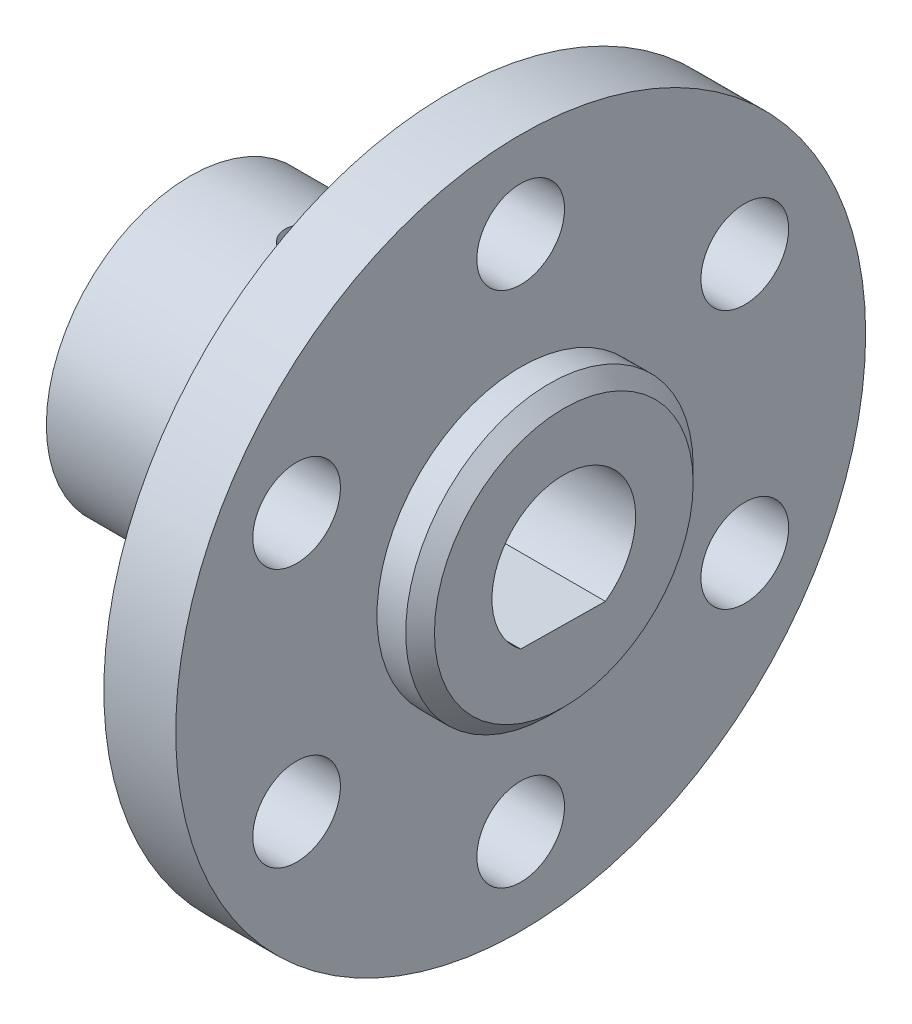
ISO-10303-21;
HEADER;
FILE_DESCRIPTION(('STEP AP214'),'2;1');
FILE_NAME('part.step','',(''),(''),'','','');
FILE_SCHEMA(('AUTOMOTIVE_DESIGN { 1 0 10303 214 1 1 1 1 }'));
ENDSEC;
DATA;
#1=APPLICATION_CONTEXT('core data for automotive mechanical design processes');
#2=APPLICATION_PROTOCOL_DEFINITION('international standard','automotive_design',2000,#1);
#3=PRODUCT_CONTEXT('',#1,'mechanical');
#4=PRODUCT('Part','Part','',(#3));
#5=PRODUCT_RELATED_PRODUCT_CATEGORY('part','',(#4));
#6=PRODUCT_DEFINITION_FORMATION('','',#4);
#7=PRODUCT_DEFINITION_CONTEXT('part definition',#1,'design');
#8=PRODUCT_DEFINITION('design','',#6,#7);
#9=PRODUCT_DEFINITION_SHAPE('','',#8);
#10=(LENGTH_UNIT() NAMED_UNIT(*) SI_UNIT(.MILLI.,.METRE.));
#11=(NAMED_UNIT(*) PLANE_ANGLE_UNIT() SI_UNIT($,.RADIAN.));
#12=(NAMED_UNIT(*) SI_UNIT($,.STERADIAN.) SOLID_ANGLE_UNIT());
#13=UNCERTAINTY_MEASURE_WITH_UNIT(LENGTH_MEASURE(1.E-05),#10,'distance_accuracy_value','');
#14=(GEOMETRIC_REPRESENTATION_CONTEXT(3) GLOBAL_UNCERTAINTY_ASSIGNED_CONTEXT((#13)) GLOBAL_UNIT_ASSIGNED_CONTEXT((#10,
#11,#12)) REPRESENTATION_CONTEXT('',''));
#15=CARTESIAN_POINT('',(0.,0.,0.));
#16=DIRECTION('',(0.,0.,1.));
#17=DIRECTION('',(1.,0.,0.));
#18=AXIS2_PLACEMENT_3D('',#15,#16,#17);
#19=CARTESIAN_POINT('',(-3.,0.,0.));
#20=DIRECTION('',(1.,0.,0.));
#21=DIRECTION('',(0.,0.,-1.));
#22=AXIS2_PLACEMENT_3D('',#19,#20,#21);
#23=TOROIDAL_SURFACE('',#22,13.,3.);
#24=CARTESIAN_POINT('',(-3.,0.,0.));
#25=DIRECTION('',(1.,0.,0.));
#26=DIRECTION('',(0.,0.,-1.));
#27=AXIS2_PLACEMENT_3D('',#24,#25,#26);
#28=CIRCLE('',#27,10.);
#29=CARTESIAN_POINT('',(-3.,0.,-10.));
#30=VERTEX_POINT('',#29);
#31=EDGE_CURVE('E144',#30,#30,#28,.F.);
#32=ORIENTED_EDGE('',*,*,#31,.F.);
#33=EDGE_LOOP('',(#32));
#34=FACE_BOUND('',#33,.T.);
#35=CARTESIAN_POINT('',(0.,0.,0.));
#36=DIRECTION('',(1.,0.,0.));
#37=DIRECTION('',(0.,0.,-1.));
#38=AXIS2_PLACEMENT_3D('',#35,#36,#37);
#39=CIRCLE('',#38,13.);
#40=CARTESIAN_POINT('',(0.,0.,-13.));
#41=VERTEX_POINT('',#40);
#42=EDGE_CURVE('E149',#41,#41,#39,.T.);
#43=ORIENTED_EDGE('',*,*,#42,.F.);
#44=EDGE_LOOP('',(#43));
#45=FACE_BOUND('',#44,.T.);
#46=ADVANCED_FACE('F41',(#34,#45),#23,.F.);
#47=CARTESIAN_POINT('',(5.,0.,0.));
#48=DIRECTION('',(1.,0.,0.));
#49=DIRECTION('',(0.,0.,-1.));
#50=AXIS2_PLACEMENT_3D('',#47,#48,#49);
#51=PLANE('',#50);
#52=CARTESIAN_POINT('',(5.,0.,0.));
#53=DIRECTION('',(1.,0.,0.));
#54=DIRECTION('',(0.,0.,-1.));
#55=AXIS2_PLACEMENT_3D('',#52,#53,#54);
#56=CIRCLE('',#55,10.);
#57=CARTESIAN_POINT('',(5.,0.,-10.));
#58=VERTEX_POINT('',#57);
#59=EDGE_CURVE('E101',#58,#58,#56,.T.);
#60=ORIENTED_EDGE('',*,*,#59,.F.);
#61=EDGE_LOOP('',(#60));
#62=FACE_BOUND('',#61,.T.);
#63=CARTESIAN_POINT('',(5.,-17.9999999999996,-8.1579586859889E-13));
#64=DIRECTION('',(1.,0.,0.));
#65=DIRECTION('',(0.,0.,-1.));
#66=AXIS2_PLACEMENT_3D('',#63,#64,#65);
#67=CIRCLE('',#66,3.0500000000004);
#68=CARTESIAN_POINT('',(5.,-17.9999999999996,-3.05000000000122));
#69=VERTEX_POINT('',#68);
#70=EDGE_CURVE('E111',#69,#69,#67,.T.);
#71=ORIENTED_EDGE('',*,*,#70,.F.);
#72=EDGE_LOOP('',(#71));
#73=FACE_BOUND('',#72,.T.);
#74=CARTESIAN_POINT('',(5.,9.00000000000091,-15.5884572681199));
#75=DIRECTION('',(1.,0.,0.));
#76=DIRECTION('',(0.,0.,-1.));
#77=AXIS2_PLACEMENT_3D('',#74,#75,#76);
#78=CIRCLE('',#77,3.05000000000092);
#79=CARTESIAN_POINT('',(5.,9.00000000000091,-18.6384572681208));
#80=VERTEX_POINT('',#79);
#81=EDGE_CURVE('E123',#80,#80,#78,.T.);
#82=ORIENTED_EDGE('',*,*,#81,.F.);
#83=EDGE_LOOP('',(#82));
#84=FACE_BOUND('',#83,.T.);
#85=CARTESIAN_POINT('',(5.,8.99999999999996,15.5884572681199));
#86=DIRECTION('',(1.,0.,0.));
#87=DIRECTION('',(0.,0.,-1.));
#88=AXIS2_PLACEMENT_3D('',#85,#86,#87);
#89=CIRCLE('',#88,3.05);
#90=CARTESIAN_POINT('',(5.,8.99999999999996,12.5384572681199));
#91=VERTEX_POINT('',#90);
#92=EDGE_CURVE('E135',#91,#91,#89,.T.);
#93=ORIENTED_EDGE('',*,*,#92,.F.);
#94=EDGE_LOOP('',(#93));
#95=FACE_BOUND('',#94,.T.);
#96=CARTESIAN_POINT('',(5.,0.,0.));
#97=DIRECTION('',(1.,0.,0.));
#98=DIRECTION('',(0.,0.,-1.));
#99=AXIS2_PLACEMENT_3D('',#96,#97,#98);
#100=CIRCLE('',#99,24.);
#101=CARTESIAN_POINT('',(5.,0.,-24.));
#102=VERTEX_POINT('',#101);
#103=EDGE_CURVE('E141',#102,#102,#100,.T.);
#104=ORIENTED_EDGE('',*,*,#103,.T.);
#105=EDGE_LOOP('',(#104));
#106=FACE_BOUND('',#105,.T.);
#107=CARTESIAN_POINT('',(5.,18.,0.));
#108=DIRECTION('',(1.,0.,0.));
#109=DIRECTION('',(0.,0.,-1.));
#110=AXIS2_PLACEMENT_3D('',#107,#108,#109);
#111=CIRCLE('',#110,3.05);
#112=CARTESIAN_POINT('',(5.,18.,-3.04999999999999));
#113=VERTEX_POINT('',#112);
#114=EDGE_CURVE('E129',#113,#113,#111,.T.);
#115=ORIENTED_EDGE('',*,*,#114,.F.);
#116=EDGE_LOOP('',(#115));
#117=FACE_BOUND('',#116,.T.);
#118=CARTESIAN_POINT('',(5.,-8.9999999999991,-15.5884572681204));
#119=DIRECTION('',(1.,0.,0.));
#120=DIRECTION('',(0.,0.,-1.));
#121=AXIS2_PLACEMENT_3D('',#118,#119,#120);
#122=CIRCLE('',#121,3.05000000000084);
#123=CARTESIAN_POINT('',(5.,-8.9999999999991,-18.6384572681213));
#124=VERTEX_POINT('',#123);
#125=EDGE_CURVE('E117',#124,#124,#122,.T.);
#126=ORIENTED_EDGE('',*,*,#125,.F.);
#127=EDGE_LOOP('',(#126));
#128=FACE_BOUND('',#127,.T.);
#129=CARTESIAN_POINT('',(5.,-9.00000000000006,15.5884572681194));
#130=DIRECTION('',(1.,0.,0.));
#131=DIRECTION('',(0.,0.,-1.));
#132=AXIS2_PLACEMENT_3D('',#129,#130,#131);
#133=CIRCLE('',#132,3.05000000000006);
#134=CARTESIAN_POINT('',(5.,-9.00000000000006,12.5384572681193));
#135=VERTEX_POINT('',#134);
#136=EDGE_CURVE('E105',#135,#135,#133,.T.);
#137=ORIENTED_EDGE('',*,*,#136,.F.);
#138=EDGE_LOOP('',(#137));
#139=FACE_BOUND('',#138,.T.);
#140=ADVANCED_FACE('F170',(#62,#73,#84,#95,#106,#117,#128,#139),#51,.T.);
#141=CARTESIAN_POINT('',(0.,0.,0.));
#142=DIRECTION('',(1.,0.,0.));
#143=DIRECTION('',(0.,0.,-1.));
#144=AXIS2_PLACEMENT_3D('',#141,#142,#143);
#145=PLANE('',#144);
#146=ORIENTED_EDGE('',*,*,#42,.T.);
#147=EDGE_LOOP('',(#146));
#148=FACE_BOUND('',#147,.T.);
#149=CARTESIAN_POINT('',(0.,0.,0.));
#150=DIRECTION('',(1.,0.,0.));
#151=DIRECTION('',(0.,0.,-1.));
#152=AXIS2_PLACEMENT_3D('',#149,#150,#151);
#153=CIRCLE('',#152,24.);
#154=CARTESIAN_POINT('',(0.,0.,-24.));
#155=VERTEX_POINT('',#154);
#156=EDGE_CURVE('E138',#155,#155,#153,.T.);
#157=ORIENTED_EDGE('',*,*,#156,.F.);
#158=EDGE_LOOP('',(#157));
#159=FACE_BOUND('',#158,.T.);
#160=CARTESIAN_POINT('',(0.,8.99999999999996,15.5884572681199));
#161=DIRECTION('',(1.,0.,0.));
#162=DIRECTION('',(0.,0.,-1.));
#163=AXIS2_PLACEMENT_3D('',#160,#161,#162);
#164=CIRCLE('',#163,3.05);
#165=CARTESIAN_POINT('',(0.,8.99999999999996,12.5384572681199));
#166=VERTEX_POINT('',#165);
#167=EDGE_CURVE('E132',#166,#166,#164,.T.);
#168=ORIENTED_EDGE('',*,*,#167,.T.);
#169=EDGE_LOOP('',(#168));
#170=FACE_BOUND('',#169,.T.);
#171=CARTESIAN_POINT('',(0.,18.,0.));
#172=DIRECTION('',(1.,0.,0.));
#173=DIRECTION('',(0.,0.,-1.));
#174=AXIS2_PLACEMENT_3D('',#171,#172,#173);
#175=CIRCLE('',#174,3.05);
#176=CARTESIAN_POINT('',(0.,18.,-3.04999999999999));
#177=VERTEX_POINT('',#176);
#178=EDGE_CURVE('E126',#177,#177,#175,.T.);
#179=ORIENTED_EDGE('',*,*,#178,.T.);
#180=EDGE_LOOP('',(#179));
#181=FACE_BOUND('',#180,.T.);
#182=CARTESIAN_POINT('',(0.,9.00000000000091,-15.5884572681199));
#183=DIRECTION('',(1.,0.,0.));
#184=DIRECTION('',(0.,0.,-1.));
#185=AXIS2_PLACEMENT_3D('',#182,#183,#184);
#186=CIRCLE('',#185,3.05000000000092);
#187=CARTESIAN_POINT('',(0.,9.00000000000091,-18.6384572681208));
#188=VERTEX_POINT('',#187);
#189=EDGE_CURVE('E120',#188,#188,#186,.T.);
#190=ORIENTED_EDGE('',*,*,#189,.T.);
#191=EDGE_LOOP('',(#190));
#192=FACE_BOUND('',#191,.T.);
#193=CARTESIAN_POINT('',(0.,-8.9999999999991,-15.5884572681204));
#194=DIRECTION('',(1.,0.,0.));
#195=DIRECTION('',(0.,0.,-1.));
#196=AXIS2_PLACEMENT_3D('',#193,#194,#195);
#197=CIRCLE('',#196,3.05000000000084);
#198=CARTESIAN_POINT('',(0.,-8.9999999999991,-18.6384572681213));
#199=VERTEX_POINT('',#198);
#200=EDGE_CURVE('E114',#199,#199,#197,.T.);
#201=ORIENTED_EDGE('',*,*,#200,.T.);
#202=EDGE_LOOP('',(#201));
#203=FACE_BOUND('',#202,.T.);
#204=CARTESIAN_POINT('',(0.,-17.9999999999996,-8.1579586859889E-13));
#205=DIRECTION('',(1.,0.,0.));
#206=DIRECTION('',(0.,0.,-1.));
#207=AXIS2_PLACEMENT_3D('',#204,#205,#206);
#208=CIRCLE('',#207,3.0500000000004);
#209=CARTESIAN_POINT('',(0.,-17.9999999999996,-3.05000000000122));
#210=VERTEX_POINT('',#209);
#211=EDGE_CURVE('E108',#210,#210,#208,.T.);
#212=ORIENTED_EDGE('',*,*,#211,.T.);
#213=EDGE_LOOP('',(#212));
#214=FACE_BOUND('',#213,.T.);
#215=CARTESIAN_POINT('',(0.,-9.00000000000006,15.5884572681194));
#216=DIRECTION('',(1.,0.,0.));
#217=DIRECTION('',(0.,0.,-1.));
#218=AXIS2_PLACEMENT_3D('',#215,#216,#217);
#219=CIRCLE('',#218,3.05000000000006);
#220=CARTESIAN_POINT('',(0.,-9.00000000000006,12.5384572681193));
#221=VERTEX_POINT('',#220);
#222=EDGE_CURVE('E104',#221,#221,#219,.T.);
#223=ORIENTED_EDGE('',*,*,#222,.T.);
#224=EDGE_LOOP('',(#223));
#225=FACE_BOUND('',#224,.T.);
#226=ADVANCED_FACE('F175',(#148,#159,#170,#181,#192,#203,#214,#225),#145,.F.);
#227=CARTESIAN_POINT('',(5.,0.,0.));
#228=DIRECTION('',(-1.,0.,0.));
#229=DIRECTION('',(0.,0.,1.));
#230=AXIS2_PLACEMENT_3D('',#227,#228,#229);
#231=CYLINDRICAL_SURFACE('',#230,24.);
#232=ORIENTED_EDGE('',*,*,#103,.F.);
#233=EDGE_LOOP('',(#232));
#234=FACE_BOUND('',#233,.T.);
#235=ORIENTED_EDGE('',*,*,#156,.T.);
#236=EDGE_LOOP('',(#235));
#237=FACE_BOUND('',#236,.T.);
#238=ADVANCED_FACE('F181',(#234,#237),#231,.T.);
#239=CARTESIAN_POINT('',(5.,8.99999999999996,15.5884572681199));
#240=DIRECTION('',(-1.,0.,0.));
#241=DIRECTION('',(0.,0.,1.));
#242=AXIS2_PLACEMENT_3D('',#239,#240,#241);
#243=CYLINDRICAL_SURFACE('',#242,3.05);
#244=ORIENTED_EDGE('',*,*,#92,.T.);
#245=EDGE_LOOP('',(#244));
#246=FACE_BOUND('',#245,.T.);
#247=ORIENTED_EDGE('',*,*,#167,.F.);
#248=EDGE_LOOP('',(#247));
#249=FACE_BOUND('',#248,.T.);
#250=ADVANCED_FACE('F184',(#246,#249),#243,.F.);
#251=CARTESIAN_POINT('',(5.,18.,0.));
#252=DIRECTION('',(-1.,0.,0.));
#253=DIRECTION('',(0.,0.,1.));
#254=AXIS2_PLACEMENT_3D('',#251,#252,#253);
#255=CYLINDRICAL_SURFACE('',#254,3.05);
#256=ORIENTED_EDGE('',*,*,#114,.T.);
#257=EDGE_LOOP('',(#256));
#258=FACE_BOUND('',#257,.T.);
#259=ORIENTED_EDGE('',*,*,#178,.F.);
#260=EDGE_LOOP('',(#259));
#261=FACE_BOUND('',#260,.T.);
#262=ADVANCED_FACE('F191',(#258,#261),#255,.F.);
#263=CARTESIAN_POINT('',(5.,9.00000000000091,-15.5884572681199));
#264=DIRECTION('',(-1.,0.,0.));
#265=DIRECTION('',(0.,0.,1.));
#266=AXIS2_PLACEMENT_3D('',#263,#264,#265);
#267=CYLINDRICAL_SURFACE('',#266,3.05000000000092);
#268=ORIENTED_EDGE('',*,*,#81,.T.);
#269=EDGE_LOOP('',(#268));
#270=FACE_BOUND('',#269,.T.);
#271=ORIENTED_EDGE('',*,*,#189,.F.);
#272=EDGE_LOOP('',(#271));
#273=FACE_BOUND('',#272,.T.);
#274=ADVANCED_FACE('F195',(#270,#273),#267,.F.);
#275=CARTESIAN_POINT('',(5.,-8.9999999999991,-15.5884572681204));
#276=DIRECTION('',(-1.,0.,0.));
#277=DIRECTION('',(0.,0.,1.));
#278=AXIS2_PLACEMENT_3D('',#275,#276,#277);
#279=CYLINDRICAL_SURFACE('',#278,3.05000000000084);
#280=ORIENTED_EDGE('',*,*,#125,.T.);
#281=EDGE_LOOP('',(#280));
#282=FACE_BOUND('',#281,.T.);
#283=ORIENTED_EDGE('',*,*,#200,.F.);
#284=EDGE_LOOP('',(#283));
#285=FACE_BOUND('',#284,.T.);
#286=ADVANCED_FACE('F199',(#282,#285),#279,.F.);
#287=CARTESIAN_POINT('',(5.,-17.9999999999996,-8.1579586859889E-13));
#288=DIRECTION('',(-1.,0.,0.));
#289=DIRECTION('',(0.,0.,1.));
#290=AXIS2_PLACEMENT_3D('',#287,#288,#289);
#291=CYLINDRICAL_SURFACE('',#290,3.0500000000004);
#292=ORIENTED_EDGE('',*,*,#70,.T.);
#293=EDGE_LOOP('',(#292));
#294=FACE_BOUND('',#293,.T.);
#295=ORIENTED_EDGE('',*,*,#211,.F.);
#296=EDGE_LOOP('',(#295));
#297=FACE_BOUND('',#296,.T.);
#298=ADVANCED_FACE('F203',(#294,#297),#291,.F.);
#299=CARTESIAN_POINT('',(5.,-9.00000000000006,15.5884572681194));
#300=DIRECTION('',(-1.,0.,0.));
#301=DIRECTION('',(0.,0.,1.));
#302=AXIS2_PLACEMENT_3D('',#299,#300,#301);
#303=CYLINDRICAL_SURFACE('',#302,3.05000000000006);
#304=ORIENTED_EDGE('',*,*,#136,.T.);
#305=EDGE_LOOP('',(#304));
#306=FACE_BOUND('',#305,.T.);
#307=ORIENTED_EDGE('',*,*,#222,.F.);
#308=EDGE_LOOP('',(#307));
#309=FACE_BOUND('',#308,.T.);
#310=ADVANCED_FACE('F207',(#306,#309),#303,.F.);
#311=CARTESIAN_POINT('',(8.,0.,0.));
#312=DIRECTION('',(-1.,0.,0.));
#313=DIRECTION('',(0.,0.,1.));
#314=AXIS2_PLACEMENT_3D('',#311,#312,#313);
#315=CYLINDRICAL_SURFACE('',#314,10.);
#316=CARTESIAN_POINT('',(7.00000000000001,0.,0.));
#317=DIRECTION('',(1.,0.,0.));
#318=DIRECTION('',(0.,0.,-1.));
#319=AXIS2_PLACEMENT_3D('',#316,#317,#318);
#320=CIRCLE('',#319,10.);
#321=CARTESIAN_POINT('',(7.00000000000001,0.,-10.));
#322=VERTEX_POINT('',#321);
#323=EDGE_CURVE('E11',#322,#322,#320,.F.);
#324=ORIENTED_EDGE('',*,*,#323,.T.);
#325=EDGE_LOOP('',(#324));
#326=FACE_BOUND('',#325,.T.);
#327=ORIENTED_EDGE('',*,*,#59,.T.);
#328=EDGE_LOOP('',(#327));
#329=FACE_BOUND('',#328,.T.);
#330=ADVANCED_FACE('F211',(#326,#329),#315,.T.);
#331=CARTESIAN_POINT('',(8.,0.,0.));
#332=DIRECTION('',(1.,0.,0.));
#333=DIRECTION('',(0.,0.,-1.));
#334=AXIS2_PLACEMENT_3D('',#331,#332,#333);
#335=PLANE('',#334);
#336=CARTESIAN_POINT('',(8.,0.,0.));
#337=DIRECTION('',(1.,0.,0.));
#338=DIRECTION('',(0.,0.,-1.));
#339=AXIS2_PLACEMENT_3D('',#336,#337,#338);
#340=CIRCLE('',#339,9.00000000000001);
#341=CARTESIAN_POINT('',(8.,0.,-9.00000000000001));
#342=VERTEX_POINT('',#341);
#343=EDGE_CURVE('E56',#342,#342,#340,.T.);
#344=ORIENTED_EDGE('',*,*,#343,.T.);
#345=EDGE_LOOP('',(#344));
#346=FACE_BOUND('',#345,.T.);
#347=DIRECTION('',(0.,0.0128300077279531,0.999917692063552));
#348=VECTOR('',#347,1.);
#349=CARTESIAN_POINT('',(8.,-4.03782841875628,0.0518096341608676));
#350=LINE('',#349,#348);
#351=CARTESIAN_POINT('',(8.,-4.07565683751256,-2.89638073167826));
#352=VERTEX_POINT('',#351);
#353=CARTESIAN_POINT('',(8.,-4.,3.));
#354=VERTEX_POINT('',#353);
#355=EDGE_CURVE('E63',#352,#354,#350,.T.);
#356=ORIENTED_EDGE('',*,*,#355,.T.);
#357=CARTESIAN_POINT('',(8.,0.,0.));
#358=DIRECTION('',(-1.,0.,0.));
#359=DIRECTION('',(0.,0.,1.));
#360=AXIS2_PLACEMENT_3D('',#357,#358,#359);
#361=CIRCLE('',#360,5.);
#362=EDGE_CURVE('E95',#354,#352,#361,.T.);
#363=ORIENTED_EDGE('',*,*,#362,.T.);
#364=EDGE_LOOP('',(#356,#363));
#365=FACE_BOUND('',#364,.T.);
#366=ADVANCED_FACE('F155',(#346,#365),#335,.T.);
#367=CARTESIAN_POINT('',(-18.,0.,0.));
#368=DIRECTION('',(1.,0.,0.));
#369=DIRECTION('',(0.,0.,-1.));
#370=AXIS2_PLACEMENT_3D('',#367,#368,#369);
#371=CYLINDRICAL_SURFACE('',#370,10.);
#372=CARTESIAN_POINT('',(-10.,-9.86680118800887,1.62672502787254));
#373=CARTESIAN_POINT('',(-9.91625443071005,-9.86680263231503,1.62672158719265));
#374=CARTESIAN_POINT('',(-9.83246024924929,-9.86796693545865,1.61970237028578));
#375=CARTESIAN_POINT('',(-9.66721468511687,-9.87250270545936,1.59181727177013));
#376=CARTESIAN_POINT('',(-9.58576566851999,-9.87587632512013,1.57093788425342));
#377=CARTESIAN_POINT('',(-9.4276262445531,-9.88446308135435,1.51596777488055));
#378=CARTESIAN_POINT('',(-9.35093223745784,-9.88967480591447,1.48188719207762));
#379=CARTESIAN_POINT('',(-9.20437296922792,-9.90138563714634,1.40150083976199));
#380=CARTESIAN_POINT('',(-9.1345067697857,-9.90788456655214,1.35519675330349));
#381=CARTESIAN_POINT('',(-9.00301618324566,-9.92154563982,1.2512755213238));
#382=CARTESIAN_POINT('',(-8.94145438659326,-9.92871219896175,1.19357975117581));
#383=CARTESIAN_POINT('',(-8.8288625143445,-9.94293094957759,1.06867544683672));
#384=CARTESIAN_POINT('',(-8.77783301783301,-9.94998313474357,1.00146638993027));
#385=CARTESIAN_POINT('',(-8.68752336830864,-9.96329209149081,0.859036178077576));
#386=CARTESIAN_POINT('',(-8.64830084967754,-9.96954487824532,0.783778076353926));
#387=CARTESIAN_POINT('',(-8.58308840119182,-9.98059103143286,0.627631569229109));
#388=CARTESIAN_POINT('',(-8.55709777215711,-9.98538447497297,0.546743461577251));
#389=CARTESIAN_POINT('',(-8.51927661146916,-9.99302708528101,0.382273201938779));
#390=CARTESIAN_POINT('',(-8.50734127361283,-9.99589057366425,0.29871582438084));
#391=CARTESIAN_POINT('',(-8.4976440651751,-9.99949809563573,0.130739602769052));
#392=CARTESIAN_POINT('',(-8.49988140668031,-10.0002422470427,0.0463208068652401));
#393=CARTESIAN_POINT('',(-8.51838333776243,-9.99962106364435,-0.120266401556699));
#394=CARTESIAN_POINT('',(-8.53453517179148,-9.99827261592517,-0.202447439502493));
#395=CARTESIAN_POINT('',(-8.58023060632257,-9.99373412761391,-0.362943016145452));
#396=CARTESIAN_POINT('',(-8.60977455150144,-9.9905440396224,-0.441257455269259));
#397=CARTESIAN_POINT('',(-8.68153099691709,-9.98274067974848,-0.592133878020595));
#398=CARTESIAN_POINT('',(-8.72379096510874,-9.97812207348032,-0.664672996873172));
#399=CARTESIAN_POINT('',(-8.81974519366998,-9.9680504405407,-0.801683727898744));
#400=CARTESIAN_POINT('',(-8.87344020670686,-9.96259735894981,-0.866154808580866));
#401=CARTESIAN_POINT('',(-8.99136844882659,-9.9514692351417,-0.985858199485323));
#402=CARTESIAN_POINT('',(-9.05570012197011,-9.94579253746999,-1.04099341641307));
#403=CARTESIAN_POINT('',(-9.19274107712373,-9.93496705522065,-1.13969409516185));
#404=CARTESIAN_POINT('',(-9.26545041071992,-9.92981827389407,-1.18325948573531));
#405=CARTESIAN_POINT('',(-9.41728396294064,-9.9206792027253,-1.25759076420924));
#406=CARTESIAN_POINT('',(-9.49641313366239,-9.91668981829193,-1.28834665685117));
#407=CARTESIAN_POINT('',(-9.65878525514739,-9.91037168884793,-1.33608318698403));
#408=CARTESIAN_POINT('',(-9.74202791554675,-9.90804282680252,-1.35306479530768));
#409=CARTESIAN_POINT('',(-9.90940008957749,-9.90535071357172,-1.3726344533727));
#410=CARTESIAN_POINT('',(-9.99351318820153,-9.90496863026455,-1.37536041165645));
#411=CARTESIAN_POINT('',(-10.1609941948173,-9.90616629519288,-1.36670687089875));
#412=CARTESIAN_POINT('',(-10.2443621258508,-9.9077459825547,-1.35532780953547));
#413=CARTESIAN_POINT('',(-10.4075598179656,-9.91265949046465,-1.31890608809892));
#414=CARTESIAN_POINT('',(-10.4874052049416,-9.91598448825837,-1.293932128547));
#415=CARTESIAN_POINT('',(-10.6417840920486,-9.92397992607637,-1.23110491003195));
#416=CARTESIAN_POINT('',(-10.7163173296282,-9.9286504325446,-1.19325101501491));
#417=CARTESIAN_POINT('',(-10.858573260335,-9.93881405366917,-1.10541270307649));
#418=CARTESIAN_POINT('',(-10.9262404472798,-9.94431309742852,-1.05533909451159));
#419=CARTESIAN_POINT('',(-11.0522728598738,-9.95544040511081,-0.944613540230506));
#420=CARTESIAN_POINT('',(-11.1106375591812,-9.96106867632495,-0.883960996356388));
#421=CARTESIAN_POINT('',(-11.2169026066336,-9.97181136290866,-0.753199197052021));
#422=CARTESIAN_POINT('',(-11.2647117282425,-9.97692110686106,-0.683015369455375));
#423=CARTESIAN_POINT('',(-11.3478729052626,-9.98592203929584,-0.535546703072782));
#424=CARTESIAN_POINT('',(-11.383225301465,-9.98981326111422,-0.458262058623935));
#425=CARTESIAN_POINT('',(-11.440323742488,-9.99584257956656,-0.299075874635991));
#426=CARTESIAN_POINT('',(-11.4621196670784,-9.99798711210867,-0.217192483507104));
#427=CARTESIAN_POINT('',(-11.4916478795375,-10.0002159387794,-0.05090215737699));
#428=CARTESIAN_POINT('',(-11.4993810962491,-10.0003003689826,0.0335046105806736));
#429=CARTESIAN_POINT('',(-11.5005417045494,-9.99831821926915,0.201559680841975));
#430=CARTESIAN_POINT('',(-11.494108680877,-9.99627273093726,0.285207301425142));
#431=CARTESIAN_POINT('',(-11.4674186115792,-9.99020242125568,0.450191223902277));
#432=CARTESIAN_POINT('',(-11.4471616101914,-9.98617760623996,0.531527533191704));
#433=CARTESIAN_POINT('',(-11.3934481244298,-9.97651214770392,0.689544857347015));
#434=CARTESIAN_POINT('',(-11.3600013048611,-9.97087268813732,0.766229233539077));
#435=CARTESIAN_POINT('',(-11.2808725120169,-9.95851544331699,0.912904087244893));
#436=CARTESIAN_POINT('',(-11.2351901415197,-9.95179762305759,0.982894347337037));
#437=CARTESIAN_POINT('',(-11.1323823011708,-9.93787880193712,1.11490741274875));
#438=CARTESIAN_POINT('',(-11.0751537741837,-9.93067386867367,1.17684955298346));
#439=CARTESIAN_POINT('',(-10.9510949269195,-9.91657161944453,1.29030397667266));
#440=CARTESIAN_POINT('',(-10.8842623561757,-9.90967437607604,1.34181380874209));
#441=CARTESIAN_POINT('',(-10.7424510167675,-9.89687136152316,1.43320800867434));
#442=CARTESIAN_POINT('',(-10.6674285829782,-9.89097137944235,1.47302542383027));
#443=CARTESIAN_POINT('',(-10.5117032232367,-9.88085115371993,1.53945424468357));
#444=CARTESIAN_POINT('',(-10.4310062921422,-9.87662916781719,1.56607935505822));
#445=CARTESIAN_POINT('',(-10.2916225637435,-9.87128792616502,1.59932985681802));
#446=CARTESIAN_POINT('',(-10.2337966030757,-9.86961382257438,1.60958740123727));
#447=CARTESIAN_POINT('',(-10.1173217082656,-9.86736995470738,1.6232861478723));
#448=CARTESIAN_POINT('',(-10.0586727848004,-9.86680017611695,1.62672743843913));
#449=CARTESIAN_POINT('',(-10.,-9.86680118800887,1.62672502787254));
#450=B_SPLINE_CURVE_WITH_KNOTS('',3,(#372,#373,#374,#375,#376,#377,#378,#379,#380,#381,#382,
#383,#384,#385,#386,#387,#388,#389,#390,#391,#392,#393,#394,#395,#396,#397,#398,#399,#400,#401,
#402,#403,#404,#405,#406,#407,#408,#409,#410,#411,#412,#413,#414,#415,#416,#417,#418,#419,#420,
#421,#422,#423,#424,#425,#426,#427,#428,#429,#430,#431,#432,#433,#434,#435,#436,#437,#438,#439,
#440,#441,#442,#443,#444,#445,#446,#447,#448,#449),.UNSPECIFIED.,.T.,.F.,(4,2,2,2,2,2,2,2,2,2,2,
2,2,2,2,2,2,2,2,2,2,2,2,2,2,2,2,2,2,2,2,2,2,2,2,2,2,2,4),(0.,0.251022251804867,
0.502289469561802,0.753364085335674,1.00440414866133,1.25724158649107,1.51009292207817,
1.76415922105782,2.018212093645,2.27035832534397,2.52249053939374,2.77259862515728,
3.02271314839401,3.27377316386454,3.52484970949272,3.77839544666269,4.0319427451435,
4.28568751773139,4.53941440444341,4.79068214603744,5.04194209099918,5.29194394807374,
5.54195815286117,5.79385486001302,6.04576581461802,6.29977537753516,6.55377799071854,
6.8068404089109,7.05988611170473,7.31044963622327,7.56101235892823,7.81139182257833,
8.06177941567107,8.3145095001097,8.56729890236862,8.82150878824931,9.07545403445564,
9.25132441891613,9.42719252376192),.UNSPECIFIED.);
#451=CARTESIAN_POINT('',(-10.,-9.86680118800887,1.62672502787254));
#452=VERTEX_POINT('',#451);
#453=EDGE_CURVE('E89',#452,#452,#450,.T.);
#454=ORIENTED_EDGE('',*,*,#453,.T.);
#455=EDGE_LOOP('',(#454));
#456=FACE_BOUND('',#455,.T.);
#457=CARTESIAN_POINT('',(-10.,9.90529121119271,1.37302804831812));
#458=CARTESIAN_POINT('',(-10.08374556929,9.90529256674275,1.37302457171309));
#459=CARTESIAN_POINT('',(-10.1675397507507,9.90627638818703,1.36597779208254));
#460=CARTESIAN_POINT('',(-10.3327853148831,9.91009519176479,1.33798549550005));
#461=CARTESIAN_POINT('',(-10.41423433148,9.91293197945993,1.31702642185017));
#462=CARTESIAN_POINT('',(-10.5723737554469,9.92010549101977,1.26185409147532));
#463=CARTESIAN_POINT('',(-10.6490677625422,9.92444106348282,1.22765100669491));
#464=CARTESIAN_POINT('',(-10.7956270307721,9.93408549403092,1.14699064365236));
#465=CARTESIAN_POINT('',(-10.8654932302143,9.93939421809198,1.10053505243859));
#466=CARTESIAN_POINT('',(-10.9969838167543,9.95038439295117,0.996297518720776));
#467=CARTESIAN_POINT('',(-11.0585456134067,9.95606824023229,0.938436864187776));
#468=CARTESIAN_POINT('',(-11.1711374856555,9.9670775271976,0.813208857288271));
#469=CARTESIAN_POINT('',(-11.222166982167,9.97240294716397,0.74584098254035));
#470=CARTESIAN_POINT('',(-11.3124766316914,9.98205306173882,0.603116181378132));
#471=CARTESIAN_POINT('',(-11.3516991503225,9.98637282485558,0.527722422592276));
#472=CARTESIAN_POINT('',(-11.4169115988082,9.99340894944727,0.371343900607148));
#473=CARTESIAN_POINT('',(-11.4429022278429,9.99612539564354,0.290359433080754));
#474=CARTESIAN_POINT('',(-11.4807233885308,9.99954552782579,0.125747226687294));
#475=CARTESIAN_POINT('',(-11.4926587263872,10.0002641663721,0.0421438866300889));
#476=CARTESIAN_POINT('',(-11.5023559348249,9.99956058300851,-0.125869595603325));
#477=CARTESIAN_POINT('',(-11.5001185933197,9.99813848011405,-0.210279692668329));
#478=CARTESIAN_POINT('',(-11.4816166622376,9.99324322271373,-0.376796119286287));
#479=CARTESIAN_POINT('',(-11.4654648282085,9.98978662579244,-0.458915503397611));
#480=CARTESIAN_POINT('',(-11.4197693936774,9.9811316516272,-0.619241793881443));
#481=CARTESIAN_POINT('',(-11.3902254484986,9.97593322955426,-0.697448599497204));
#482=CARTESIAN_POINT('',(-11.3184690030829,9.96426126600314,-0.848075133130636));
#483=CARTESIAN_POINT('',(-11.2762090348913,9.95778297855756,-0.920471867031698));
#484=CARTESIAN_POINT('',(-11.18025480633,9.94419925327684,-1.05717907464611));
#485=CARTESIAN_POINT('',(-11.1265597932931,9.93709377417728,-1.12148901563444));
#486=CARTESIAN_POINT('',(-11.0086315511734,9.92289797590559,-1.24086747367836));
#487=CARTESIAN_POINT('',(-10.9442998780299,9.91580849303436,-1.29583888692875));
#488=CARTESIAN_POINT('',(-10.8072589228763,9.90245412224666,-1.39422931243989));
#489=CARTESIAN_POINT('',(-10.7345495892801,9.89618923940823,-1.43764825355997));
#490=CARTESIAN_POINT('',(-10.5827160370594,9.88514599222285,-1.51172057141893));
#491=CARTESIAN_POINT('',(-10.5035868663376,9.88036878944403,-1.5423639794208));
#492=CARTESIAN_POINT('',(-10.3412147448526,9.87282792076283,-1.58992268386415));
#493=CARTESIAN_POINT('',(-10.2579720844532,9.87006411295468,-1.60683894781585));
#494=CARTESIAN_POINT('',(-10.0905999104225,9.8668707696197,-1.62633308921203));
#495=CARTESIAN_POINT('',(-10.0064868117985,9.8664188697269,-1.62904834660412));
#496=CARTESIAN_POINT('',(-9.83900580518266,9.86783817207525,-1.62042838432058));
#497=CARTESIAN_POINT('',(-9.75563787414923,9.86970930223287,-1.60909360061713));
#498=CARTESIAN_POINT('',(-9.59244018203437,9.87555569753809,-1.5728099401855));
#499=CARTESIAN_POINT('',(-9.5125947950584,9.87952038012455,-1.54792951498782));
#500=CARTESIAN_POINT('',(-9.35821590795139,9.88912520040456,-1.48532812650779));
#501=CARTESIAN_POINT('',(-9.2836826703718,9.89476542083998,-1.44760652908574));
#502=CARTESIAN_POINT('',(-9.14142673966496,9.90717944284096,-1.36005791232731));
#503=CARTESIAN_POINT('',(-9.07375955272018,9.91396146002814,-1.31014188283928));
#504=CARTESIAN_POINT('',(-8.94772714012619,9.92792608997757,-1.19973828481147));
#505=CARTESIAN_POINT('',(-8.88936244081884,9.93510872537609,-1.13925011849777));
#506=CARTESIAN_POINT('',(-8.78309739336641,9.94920294889118,-1.00880700317213));
#507=CARTESIAN_POINT('',(-8.73528827175752,9.95611178049393,-0.938777386685535));
#508=CARTESIAN_POINT('',(-8.65212709473736,9.96889348645939,-0.791588214726561));
#509=CARTESIAN_POINT('',(-8.61677469853497,9.97476638916087,-0.714428854382637));
#510=CARTESIAN_POINT('',(-8.55967625751197,9.98487810638848,-0.555449777053725));
#511=CARTESIAN_POINT('',(-8.53788033292164,9.98912288905381,-0.473648367636073));
#512=CARTESIAN_POINT('',(-8.50835212046253,9.99561764308396,-0.307469974326726));
#513=CARTESIAN_POINT('',(-8.50061890375085,9.99786774619249,-0.223093160914989));
#514=CARTESIAN_POINT('',(-8.49945829545059,10.000198189803,-0.0550425596349123));
#515=CARTESIAN_POINT('',(-8.50589131912302,10.0002995974544,0.0286300055715497));
#516=CARTESIAN_POINT('',(-8.53258138842076,9.99846442778016,0.193715363758878));
#517=CARTESIAN_POINT('',(-8.55283838980856,9.99652785697612,0.275128163970251));
#518=CARTESIAN_POINT('',(-8.60655187557023,9.99091997372883,0.433341461348826));
#519=CARTESIAN_POINT('',(-8.63999869513893,9.98724993109409,0.510145288357825));
#520=CARTESIAN_POINT('',(-8.71912748798314,9.97866012373604,0.657088915027116));
#521=CARTESIAN_POINT('',(-8.76480985848034,9.97374031844001,0.727228498235548));
#522=CARTESIAN_POINT('',(-8.86761769882917,9.96321325813295,0.859555230312144));
#523=CARTESIAN_POINT('',(-8.92484622581634,9.95760000231721,0.921661841549073));
#524=CARTESIAN_POINT('',(-9.04890507308047,9.94641339845219,1.03544074812642));
#525=CARTESIAN_POINT('',(-9.11573764382434,9.94084006007882,1.08711059102612));
#526=CARTESIAN_POINT('',(-9.25754898323254,9.9303862440675,1.17880320083574));
#527=CARTESIAN_POINT('',(-9.33257141702183,9.92550983576117,1.21875888854455));
#528=CARTESIAN_POINT('',(-9.4882967767633,9.91709736607183,1.28542550359555));
#529=CARTESIAN_POINT('',(-9.56899370785782,9.91355991463456,1.31215017580597));
#530=CARTESIAN_POINT('',(-9.70837743625647,9.90907356957958,1.34552677595807));
#531=CARTESIAN_POINT('',(-9.76620339692427,9.90766320421848,1.35582389739531));
#532=CARTESIAN_POINT('',(-9.88267829173435,9.90577155619192,1.36957570709873));
#533=CARTESIAN_POINT('',(-9.94132721519961,9.90529026148402,1.37303048405413));
#534=CARTESIAN_POINT('',(-10.,9.90529121119271,1.37302804831812));
#535=B_SPLINE_CURVE_WITH_KNOTS('',3,(#457,#458,#459,#460,#461,#462,#463,#464,#465,#466,#467,
#468,#469,#470,#471,#472,#473,#474,#475,#476,#477,#478,#479,#480,#481,#482,#483,#484,#485,#486,
#487,#488,#489,#490,#491,#492,#493,#494,#495,#496,#497,#498,#499,#500,#501,#502,#503,#504,#505,
#506,#507,#508,#509,#510,#511,#512,#513,#514,#515,#516,#517,#518,#519,#520,#521,#522,#523,#524,
#525,#526,#527,#528,#529,#530,#531,#532,#533,#534),.UNSPECIFIED.,.T.,.F.,(4,2,2,2,2,2,2,2,2,2,2,
2,2,2,2,2,2,2,2,2,2,2,2,2,2,2,2,2,2,2,2,2,2,2,2,2,2,2,4),(0.,0.251022251804867,
0.502289469561802,0.753364085335675,1.00440414866133,1.25724158649107,1.51009292207817,
1.76415922105782,2.018212093645,2.27035832534397,2.52249053939374,2.77259862515728,
3.02271314839401,3.27377316386453,3.52484970949272,3.77839544666269,4.0319427451435,
4.28568751773139,4.53941440444341,4.79068214603744,5.04194209099918,5.29194394807374,
5.54195815286117,5.79385486001302,6.04576581461802,6.29977537753516,6.55377799071854,
6.8068404089109,7.05988611170473,7.31044963622327,7.56101235892823,7.81139182257833,
8.06177941567107,8.3145095001097,8.56729890236863,8.82150878824931,9.07545403445564,
9.25132441891613,9.42719252376192),.UNSPECIFIED.);
#536=CARTESIAN_POINT('',(-10.,9.90529121119271,1.37302804831812));
#537=VERTEX_POINT('',#536);
#538=EDGE_CURVE('E92',#537,#537,#535,.T.);
#539=ORIENTED_EDGE('',*,*,#538,.T.);
#540=EDGE_LOOP('',(#539));
#541=FACE_BOUND('',#540,.T.);
#542=ORIENTED_EDGE('',*,*,#31,.T.);
#543=EDGE_LOOP('',(#542));
#544=FACE_BOUND('',#543,.T.);
#545=CARTESIAN_POINT('',(-18.,0.,0.));
#546=DIRECTION('',(-1.,0.,0.));
#547=DIRECTION('',(0.,0.,1.));
#548=AXIS2_PLACEMENT_3D('',#545,#546,#547);
#549=CIRCLE('',#548,10.);
#550=CARTESIAN_POINT('',(-18.,0.,10.));
#551=VERTEX_POINT('',#550);
#552=EDGE_CURVE('E79',#551,#551,#549,.T.);
#553=ORIENTED_EDGE('',*,*,#552,.F.);
#554=EDGE_LOOP('',(#553));
#555=FACE_BOUND('',#554,.T.);
#556=ADVANCED_FACE('F218',(#456,#541,#544,#555),#371,.T.);
#557=CARTESIAN_POINT('',(-18.,0.,0.));
#558=DIRECTION('',(-1.,0.,0.));
#559=DIRECTION('',(0.,0.,1.));
#560=AXIS2_PLACEMENT_3D('',#557,#558,#559);
#561=PLANE('',#560);
#562=DIRECTION('',(0.,0.0128300077279531,0.999917692063552));
#563=VECTOR('',#562,1.);
#564=CARTESIAN_POINT('',(-18.,-4.03782841875628,0.0518096341608676));
#565=LINE('',#564,#563);
#566=CARTESIAN_POINT('',(-18.,-4.07565683751256,-2.89638073167826));
#567=VERTEX_POINT('',#566);
#568=CARTESIAN_POINT('',(-18.,-4.,3.));
#569=VERTEX_POINT('',#568);
#570=EDGE_CURVE('E68',#567,#569,#565,.T.);
#571=ORIENTED_EDGE('',*,*,#570,.F.);
#572=CARTESIAN_POINT('',(-18.,0.,0.));
#573=DIRECTION('',(-1.,0.,0.));
#574=DIRECTION('',(0.,0.,1.));
#575=AXIS2_PLACEMENT_3D('',#572,#573,#574);
#576=CIRCLE('',#575,5.);
#577=EDGE_CURVE('E83',#569,#567,#576,.T.);
#578=ORIENTED_EDGE('',*,*,#577,.F.);
#579=EDGE_LOOP('',(#571,#578));
#580=FACE_BOUND('',#579,.T.);
#581=ORIENTED_EDGE('',*,*,#552,.T.);
#582=EDGE_LOOP('',(#581));
#583=FACE_BOUND('',#582,.T.);
#584=ADVANCED_FACE('F87',(#580,#583),#561,.T.);
#585=CARTESIAN_POINT('',(8.,-4.03782841875628,0.0518096341608676));
#586=DIRECTION('',(0.,-0.999917692063552,0.0128300077279531));
#587=DIRECTION('',(0.,-0.0128300077279531,-0.999917692063552));
#588=AXIS2_PLACEMENT_3D('',#585,#586,#587);
#589=PLANE('',#588);
#590=CARTESIAN_POINT('',(-10.,-4.03782841875628,0.0518096341608676));
#591=DIRECTION('',(0.,-0.999917692063552,0.0128300077279531));
#592=DIRECTION('',(0.,-0.0128300077279531,-0.999917692063552));
#593=AXIS2_PLACEMENT_3D('',#590,#591,#592);
#594=CIRCLE('',#593,1.5);
#595=CARTESIAN_POINT('',(-10.,-4.05707343034821,-1.44806690393446));
#596=VERTEX_POINT('',#595);
#597=EDGE_CURVE('E246',#596,#596,#594,.T.);
#598=ORIENTED_EDGE('',*,*,#597,.T.);
#599=EDGE_LOOP('',(#598));
#600=FACE_BOUND('',#599,.T.);
#601=ORIENTED_EDGE('',*,*,#570,.T.);
#602=DIRECTION('',(-1.,0.,0.));
#603=VECTOR('',#602,1.);
#604=CARTESIAN_POINT('',(8.,-4.,3.));
#605=LINE('',#604,#603);
#606=EDGE_CURVE('E80',#354,#569,#605,.T.);
#607=ORIENTED_EDGE('',*,*,#606,.F.);
#608=ORIENTED_EDGE('',*,*,#355,.F.);
#609=DIRECTION('',(-1.,0.,0.));
#610=VECTOR('',#609,1.);
#611=CARTESIAN_POINT('',(8.,-4.07565683751256,-2.89638073167826));
#612=LINE('',#611,#610);
#613=EDGE_CURVE('E73',#352,#567,#612,.T.);
#614=ORIENTED_EDGE('',*,*,#613,.T.);
#615=EDGE_LOOP('',(#601,#607,#608,#614));
#616=FACE_BOUND('',#615,.T.);
#617=ADVANCED_FACE('F75',(#600,#616),#589,.F.);
#618=CARTESIAN_POINT('',(8.,0.,0.));
#619=DIRECTION('',(-1.,0.,0.));
#620=DIRECTION('',(0.,0.,1.));
#621=AXIS2_PLACEMENT_3D('',#618,#619,#620);
#622=CYLINDRICAL_SURFACE('',#621,5.);
#623=CARTESIAN_POINT('',(-10.,4.78854843484083,1.43868130146445));
#624=CARTESIAN_POINT('',(-9.91780545205759,4.78854927182233,1.43868026697846));
#625=CARTESIAN_POINT('',(-9.83560077585597,4.79060917948344,1.43187538358512));
#626=CARTESIAN_POINT('',(-9.67359475040806,4.79858572762198,1.40490818759268));
#627=CARTESIAN_POINT('',(-9.59379421349853,4.8045036567322,1.38474141189906));
#628=CARTESIAN_POINT('',(-9.43896527172827,4.81944475436712,1.33180363726572));
#629=CARTESIAN_POINT('',(-9.36392917036691,4.82846275558929,1.2990536018954));
#630=CARTESIAN_POINT('',(-9.2203780660047,4.8485461287528,1.2219579117122));
#631=CARTESIAN_POINT('',(-9.15186404131556,4.85961180711521,1.17761052102232));
#632=CARTESIAN_POINT('',(-9.02113360942262,4.88288957855365,1.07708868333558));
#633=CARTESIAN_POINT('',(-8.95915410205371,4.89512544523492,1.02061157889938));
#634=CARTESIAN_POINT('',(-8.84536204867749,4.91907610744663,0.89809837373054));
#635=CARTESIAN_POINT('',(-8.79355080955012,4.93079083584816,0.83206104615997));
#636=CARTESIAN_POINT('',(-8.70053730016669,4.95260052590042,0.690626378805022));
#637=CARTESIAN_POINT('',(-8.65957657555719,4.96265698174149,0.61506371853435));
#638=CARTESIAN_POINT('',(-8.59101274095724,4.97962746172657,0.457773664958799));
#639=CARTESIAN_POINT('',(-8.56340675014255,4.98654216357632,0.376047605595887));
#640=CARTESIAN_POINT('',(-8.52311999890949,4.99619789737288,0.211239981724144));
#641=CARTESIAN_POINT('',(-8.5100348723473,4.99905266443464,0.12826407178773));
#642=CARTESIAN_POINT('',(-8.49788267535356,5.00054658550655,-0.0387384160658102));
#643=CARTESIAN_POINT('',(-8.49881266059804,4.99918662500316,-0.122764769597492));
#644=CARTESIAN_POINT('',(-8.51439286854302,4.99242926308536,-0.286647656003857));
#645=CARTESIAN_POINT('',(-8.52860519380987,4.98716182310553,-0.366551762491509));
#646=CARTESIAN_POINT('',(-8.56963133599429,4.97321781534883,-0.522738661986814));
#647=CARTESIAN_POINT('',(-8.59644595094267,4.96454103168345,-0.599021225326028));
#648=CARTESIAN_POINT('',(-8.66221202341856,4.94447713350039,-0.746846477577189));
#649=CARTESIAN_POINT('',(-8.70130120280727,4.93305962845468,-0.818323612377884));
#650=CARTESIAN_POINT('',(-8.79039785242823,4.90866289292675,-0.953821363701506));
#651=CARTESIAN_POINT('',(-8.84040791296348,4.89568329226247,-1.01784020567243));
#652=CARTESIAN_POINT('',(-8.95219775075159,4.8689000234226,-1.13922227349143));
#653=CARTESIAN_POINT('',(-9.01435691902974,4.85508387620526,-1.19623380358857));
#654=CARTESIAN_POINT('',(-9.14751001789005,4.82856932885608,-1.29913402624328));
#655=CARTESIAN_POINT('',(-9.21850482538923,4.81587103988298,-1.34502161344053));
#656=CARTESIAN_POINT('',(-9.36823946924899,4.79289397054613,-1.42475008827559));
#657=CARTESIAN_POINT('',(-9.44704704586292,4.78263955888974,-1.45847123863538));
#658=CARTESIAN_POINT('',(-9.60960720844554,4.7659558783084,-1.51210533780396));
#659=CARTESIAN_POINT('',(-9.69335817153456,4.75952536161864,-1.53202279121109));
#660=CARTESIAN_POINT('',(-9.86008236073928,4.7514653456698,-1.55683717998136));
#661=CARTESIAN_POINT('',(-9.94296822389398,4.74966583319503,-1.56226630006254));
#662=CARTESIAN_POINT('',(-10.1084729000099,4.75059533451007,-1.55943800130867));
#663=CARTESIAN_POINT('',(-10.1910917487308,4.75332371439102,-1.55118249833289));
#664=CARTESIAN_POINT('',(-10.3514883779709,4.76284430825361,-1.52169021220511));
#665=CARTESIAN_POINT('',(-10.4293361642635,4.76952910785394,-1.50079623706656));
#666=CARTESIAN_POINT('',(-10.5804016908149,4.786120187768,-1.44701083695138));
#667=CARTESIAN_POINT('',(-10.6536187141406,4.79602696545607,-1.41411755955609));
#668=CARTESIAN_POINT('',(-10.7955174640721,4.81831086763267,-1.33624766142));
#669=CARTESIAN_POINT('',(-10.8640247209858,4.83074715903449,-1.29097042222095));
#670=CARTESIAN_POINT('',(-10.9926381061808,4.85661458092536,-1.18996136187295));
#671=CARTESIAN_POINT('',(-11.0527422176128,4.87004594906461,-1.13422703839794));
#672=CARTESIAN_POINT('',(-11.1651804058147,4.89706354676659,-1.01136773923449));
#673=CARTESIAN_POINT('',(-11.217135628987,4.91063648999862,-0.943892259797413));
#674=CARTESIAN_POINT('',(-11.3089667010278,4.93597979450568,-0.800856360333183));
#675=CARTESIAN_POINT('',(-11.3488431497815,4.94775024528608,-0.725296342072171));
#676=CARTESIAN_POINT('',(-11.4150000305683,4.96817189142408,-0.568723998964751));
#677=CARTESIAN_POINT('',(-11.441382016159,4.97684623256824,-0.487757743995914));
#678=CARTESIAN_POINT('',(-11.4800609188904,4.9902964258389,-0.322222029643211));
#679=CARTESIAN_POINT('',(-11.4923618659484,4.99507339326024,-0.237653608370074));
#680=CARTESIAN_POINT('',(-11.5022230440545,5.00016849917497,-0.0708101826082303));
#681=CARTESIAN_POINT('',(-11.5003326954078,5.00065126220393,0.011427725339828));
#682=CARTESIAN_POINT('',(-11.4831783675009,4.99762172554598,0.174414311486333));
#683=CARTESIAN_POINT('',(-11.4679151465196,4.994109652374,0.255163073858397));
#684=CARTESIAN_POINT('',(-11.4247883386004,4.9836082221041,0.412029994377268));
#685=CARTESIAN_POINT('',(-11.397061819351,4.97665661042394,0.488188566373784));
#686=CARTESIAN_POINT('',(-11.3299180854928,4.96008278406264,0.634847590296363));
#687=CARTESIAN_POINT('',(-11.2904989497138,4.95046013052926,0.705347109984073));
#688=CARTESIAN_POINT('',(-11.19962654257,4.9292370648548,0.841128974375736));
#689=CARTESIAN_POINT('',(-11.1478285699992,4.91758322174952,0.906172204503092));
#690=CARTESIAN_POINT('',(-11.0342896116672,4.89381246548074,1.0268344362182));
#691=CARTESIAN_POINT('',(-10.9725457621018,4.88169541971195,1.08245071392609));
#692=CARTESIAN_POINT('',(-10.8386592216895,4.85800164679822,1.18433197519561));
#693=CARTESIAN_POINT('',(-10.7662614466096,4.84645178716406,1.23026884458697));
#694=CARTESIAN_POINT('',(-10.614444825839,4.82572018929982,1.30923686855108));
#695=CARTESIAN_POINT('',(-10.5350293763988,4.81653731388922,1.34227422443528));
#696=CARTESIAN_POINT('',(-10.3802595683937,4.80252663356845,1.39151750444144));
#697=CARTESIAN_POINT('',(-10.305391353069,4.79733587314836,1.40915471840325));
#698=CARTESIAN_POINT('',(-10.1536847775042,4.790346722559,1.43273592841918));
#699=CARTESIAN_POINT('',(-10.0768468153547,4.78854765231494,1.43868226864482));
#700=CARTESIAN_POINT('',(-10.,4.78854843484083,1.43868130146445));
#701=B_SPLINE_CURVE_WITH_KNOTS('',3,(#623,#624,#625,#626,#627,#628,#629,#630,#631,#632,#633,
#634,#635,#636,#637,#638,#639,#640,#641,#642,#643,#644,#645,#646,#647,#648,#649,#650,#651,#652,
#653,#654,#655,#656,#657,#658,#659,#660,#661,#662,#663,#664,#665,#666,#667,#668,#669,#670,#671,
#672,#673,#674,#675,#676,#677,#678,#679,#680,#681,#682,#683,#684,#685,#686,#687,#688,#689,#690,
#691,#692,#693,#694,#695,#696,#697,#698,#699,#700),.UNSPECIFIED.,.T.,.F.,(4,2,2,2,2,2,2,2,2,2,2,
2,2,2,2,2,2,2,2,2,2,2,2,2,2,2,2,2,2,2,2,2,2,2,2,2,2,2,4),(0.,0.246300165915542,
0.492682641689001,0.738656414466195,0.984667025370102,1.23773150007984,1.49082847871273,
1.74915939273645,2.00743455587877,2.25832140149558,2.50915554101441,2.7520012599088,
2.99486235890376,3.24055209335676,3.48630016590831,3.74152147023278,3.99676812491863,
4.25446238246267,4.51207250628412,4.7600808079031,5.00805439107388,5.24958594938817,
5.49115481045788,5.73920731809389,5.98731925928923,6.24479506100602,6.50225807324202,
6.75775391814325,7.01317662321682,7.2587630391122,7.50433553047755,7.74727096872219,
7.99024634491378,8.24099627054489,8.4918185262989,8.75011639669147,9.00828993963944,
9.23861153857448,9.4688869503356),.UNSPECIFIED.);
#702=CARTESIAN_POINT('',(-10.,4.78854843484083,1.43868130146445));
#703=VERTEX_POINT('',#702);
#704=EDGE_CURVE('E46',#703,#703,#701,.T.);
#705=ORIENTED_EDGE('',*,*,#704,.T.);
#706=EDGE_LOOP('',(#705));
#707=FACE_BOUND('',#706,.T.);
#708=ORIENTED_EDGE('',*,*,#577,.T.);
#709=ORIENTED_EDGE('',*,*,#613,.F.);
#710=ORIENTED_EDGE('',*,*,#362,.F.);
#711=ORIENTED_EDGE('',*,*,#606,.T.);
#712=EDGE_LOOP('',(#708,#709,#710,#711));
#713=FACE_BOUND('',#712,.T.);
#714=ADVANCED_FACE('F84',(#707,#713),#622,.F.);
#715=CARTESIAN_POINT('',(8.,0.,0.));
#716=DIRECTION('',(-1.,0.,0.));
#717=DIRECTION('',(0.,0.,1.));
#718=AXIS2_PLACEMENT_3D('',#715,#716,#717);
#719=CONICAL_SURFACE('',#718,9.00000000000001,0.785398163397448);
#720=ORIENTED_EDGE('',*,*,#323,.F.);
#721=EDGE_LOOP('',(#720));
#722=FACE_BOUND('',#721,.T.);
#723=ORIENTED_EDGE('',*,*,#343,.F.);
#724=EDGE_LOOP('',(#723));
#725=FACE_BOUND('',#724,.T.);
#726=ADVANCED_FACE('F44',(#722,#725),#719,.T.);
#727=CARTESIAN_POINT('',(-10.,-24.3039442228366,0.311845459554994));
#728=DIRECTION('',(0.,0.999917692063552,-0.0128300077279527));
#729=DIRECTION('',(0.,0.0128300077279527,0.999917692063552));
#730=AXIS2_PLACEMENT_3D('',#727,#728,#729);
#731=CYLINDRICAL_SURFACE('',#730,1.5);
#732=ORIENTED_EDGE('',*,*,#704,.F.);
#733=EDGE_LOOP('',(#732));
#734=FACE_BOUND('',#733,.T.);
#735=ORIENTED_EDGE('',*,*,#538,.F.);
#736=EDGE_LOOP('',(#735));
#737=FACE_BOUND('',#736,.T.);
#738=ADVANCED_FACE('F159',(#734,#737),#731,.F.);
#739=ORIENTED_EDGE('',*,*,#597,.F.);
#740=EDGE_LOOP('',(#739));
#741=FACE_BOUND('',#740,.T.);
#742=ORIENTED_EDGE('',*,*,#453,.F.);
#743=EDGE_LOOP('',(#742));
#744=FACE_BOUND('',#743,.T.);
#745=ADVANCED_FACE('F165',(#741,#744),#731,.F.);
#746=CLOSED_SHELL('',(#46,#140,#226,#238,#250,#262,#274,#286,#298,#310,#330,#366,#556,#584,#617,
#714,#726,#738,#745));
#747=MANIFOLD_SOLID_BREP('B2',#746);
#748=ADVANCED_BREP_SHAPE_REPRESENTATION('',(#18,#747),#14);
#749=SHAPE_DEFINITION_REPRESENTATION(#9,#748);
ENDSEC;
END-ISO-10303-21;
